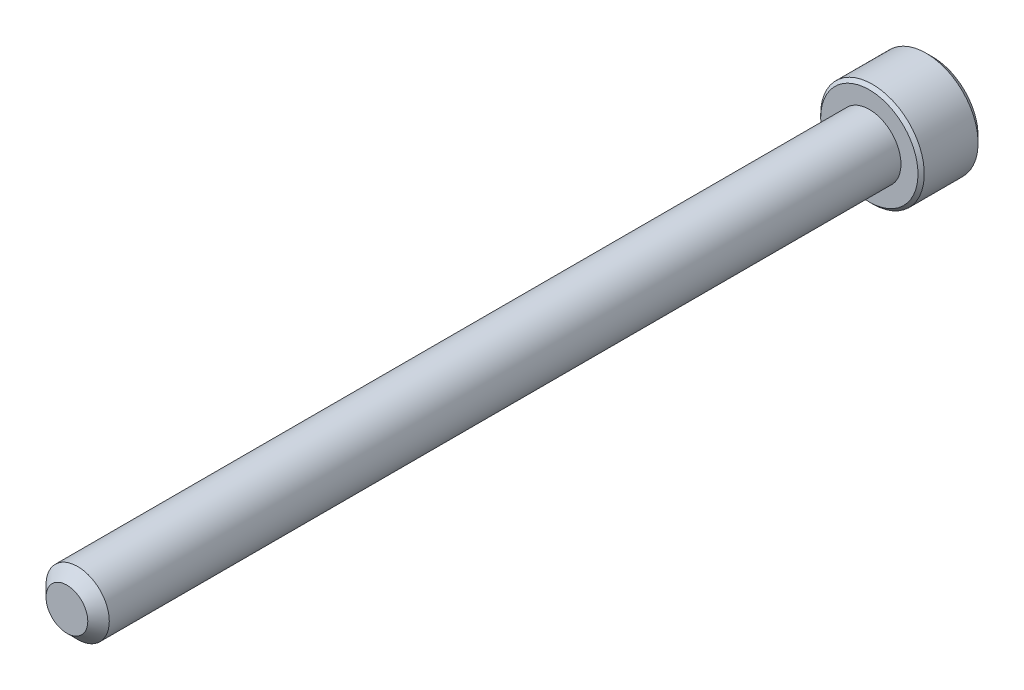
ISO-10303-21;
HEADER;
FILE_DESCRIPTION(('STEP AP214'),'2;1');
FILE_NAME('part.step','',(''),(''),'','','');
FILE_SCHEMA(('AUTOMOTIVE_DESIGN { 1 0 10303 214 1 1 1 1 }'));
ENDSEC;
DATA;
#1=APPLICATION_CONTEXT('core data for automotive mechanical design processes');
#2=APPLICATION_PROTOCOL_DEFINITION('international standard','automotive_design',2000,#1);
#3=PRODUCT_CONTEXT('',#1,'mechanical');
#4=PRODUCT('Part','Part','',(#3));
#5=PRODUCT_RELATED_PRODUCT_CATEGORY('part','',(#4));
#6=PRODUCT_DEFINITION_FORMATION('','',#4);
#7=PRODUCT_DEFINITION_CONTEXT('part definition',#1,'design');
#8=PRODUCT_DEFINITION('design','',#6,#7);
#9=PRODUCT_DEFINITION_SHAPE('','',#8);
#10=(LENGTH_UNIT() NAMED_UNIT(*) SI_UNIT(.MILLI.,.METRE.));
#11=(NAMED_UNIT(*) PLANE_ANGLE_UNIT() SI_UNIT($,.RADIAN.));
#12=(NAMED_UNIT(*) SI_UNIT($,.STERADIAN.) SOLID_ANGLE_UNIT());
#13=UNCERTAINTY_MEASURE_WITH_UNIT(LENGTH_MEASURE(1.E-05),#10,'distance_accuracy_value','');
#14=(GEOMETRIC_REPRESENTATION_CONTEXT(3) GLOBAL_UNCERTAINTY_ASSIGNED_CONTEXT((#13)) GLOBAL_UNIT_ASSIGNED_CONTEXT((#10,
#11,#12)) REPRESENTATION_CONTEXT('',''));
#15=CARTESIAN_POINT('',(0.,0.,0.));
#16=DIRECTION('',(0.,0.,1.));
#17=DIRECTION('',(1.,0.,0.));
#18=AXIS2_PLACEMENT_3D('',#15,#16,#17);
#19=CARTESIAN_POINT('',(0.,0.,-44.45));
#20=DIRECTION('',(0.,0.,1.));
#21=DIRECTION('',(1.,0.,0.));
#22=AXIS2_PLACEMENT_3D('',#19,#20,#21);
#23=CYLINDRICAL_SURFACE('',#22,1.7526);
#24=CARTESIAN_POINT('',(0.,0.,-44.45));
#25=DIRECTION('',(0.,0.,-1.));
#26=DIRECTION('',(-1.,0.,0.));
#27=AXIS2_PLACEMENT_3D('',#24,#25,#26);
#28=CIRCLE('',#27,1.7526);
#29=CARTESIAN_POINT('',(-1.7526,0.,-44.45));
#30=VERTEX_POINT('',#29);
#31=EDGE_CURVE('E215',#30,#30,#28,.F.);
#32=ORIENTED_EDGE('',*,*,#31,.T.);
#33=EDGE_LOOP('',(#32));
#34=FACE_BOUND('',#33,.T.);
#35=CARTESIAN_POINT('',(0.,0.,-0.5953125));
#36=DIRECTION('',(0.,0.,1.));
#37=DIRECTION('',(1.,0.,0.));
#38=AXIS2_PLACEMENT_3D('',#35,#36,#37);
#39=CIRCLE('',#38,1.7526);
#40=CARTESIAN_POINT('',(1.7526,0.,-0.5953125));
#41=VERTEX_POINT('',#40);
#42=EDGE_CURVE('E111',#41,#41,#39,.F.);
#43=ORIENTED_EDGE('',*,*,#42,.T.);
#44=EDGE_LOOP('',(#43));
#45=FACE_BOUND('',#44,.T.);
#46=ADVANCED_FACE('F37',(#34,#45),#23,.T.);
#47=CARTESIAN_POINT('',(0.,0.,0.));
#48=DIRECTION('',(0.,0.,1.));
#49=DIRECTION('',(1.,0.,0.));
#50=AXIS2_PLACEMENT_3D('',#47,#48,#49);
#51=PLANE('',#50);
#52=CARTESIAN_POINT('',(0.,0.,0.));
#53=DIRECTION('',(0.,0.,1.));
#54=DIRECTION('',(1.,0.,0.));
#55=AXIS2_PLACEMENT_3D('',#52,#53,#54);
#56=CIRCLE('',#55,1.15728750000001);
#57=CARTESIAN_POINT('',(1.15728750000001,0.,0.));
#58=VERTEX_POINT('',#57);
#59=EDGE_CURVE('E214',#58,#58,#56,.T.);
#60=ORIENTED_EDGE('',*,*,#59,.T.);
#61=EDGE_LOOP('',(#60));
#62=FACE_BOUND('',#61,.T.);
#63=ADVANCED_FACE('F191',(#62),#51,.T.);
#64=CARTESIAN_POINT('',(0.,0.,0.));
#65=DIRECTION('',(0.,0.,-1.));
#66=DIRECTION('',(-1.,0.,0.));
#67=AXIS2_PLACEMENT_3D('',#64,#65,#66);
#68=CONICAL_SURFACE('',#67,1.15728750000001,0.785398163397443);
#69=ORIENTED_EDGE('',*,*,#42,.F.);
#70=EDGE_LOOP('',(#69));
#71=FACE_BOUND('',#70,.T.);
#72=ORIENTED_EDGE('',*,*,#59,.F.);
#73=EDGE_LOOP('',(#72));
#74=FACE_BOUND('',#73,.T.);
#75=ADVANCED_FACE('F197',(#71,#74),#68,.T.);
#76=CARTESIAN_POINT('',(0.,0.,-47.9552));
#77=DIRECTION('',(0.,0.,1.));
#78=DIRECTION('',(1.,0.,0.));
#79=AXIS2_PLACEMENT_3D('',#76,#77,#78);
#80=CYLINDRICAL_SURFACE('',#79,2.8702);
#81=CARTESIAN_POINT('',(0.,0.,-44.62526));
#82=DIRECTION('',(0.,0.,-1.));
#83=DIRECTION('',(-1.,0.,0.));
#84=AXIS2_PLACEMENT_3D('',#81,#82,#83);
#85=CIRCLE('',#84,2.8702);
#86=CARTESIAN_POINT('',(-2.8702,0.,-44.62526));
#87=VERTEX_POINT('',#86);
#88=EDGE_CURVE('E45',#87,#87,#85,.T.);
#89=ORIENTED_EDGE('',*,*,#88,.T.);
#90=EDGE_LOOP('',(#89));
#91=FACE_BOUND('',#90,.T.);
#92=CARTESIAN_POINT('',(0.,0.,-47.60468));
#93=DIRECTION('',(0.,0.,-1.));
#94=DIRECTION('',(-1.,0.,0.));
#95=AXIS2_PLACEMENT_3D('',#92,#93,#94);
#96=CIRCLE('',#95,2.8702);
#97=CARTESIAN_POINT('',(-2.8702,0.,-47.60468));
#98=VERTEX_POINT('',#97);
#99=EDGE_CURVE('E174',#98,#98,#96,.F.);
#100=ORIENTED_EDGE('',*,*,#99,.T.);
#101=EDGE_LOOP('',(#100));
#102=FACE_BOUND('',#101,.T.);
#103=ADVANCED_FACE('F179',(#91,#102),#80,.T.);
#104=CARTESIAN_POINT('',(0.,0.,-47.9552));
#105=DIRECTION('',(0.,0.,-1.));
#106=DIRECTION('',(-1.,0.,0.));
#107=AXIS2_PLACEMENT_3D('',#104,#105,#106);
#108=PLANE('',#107);
#109=CARTESIAN_POINT('',(0.,0.,-47.9552));
#110=DIRECTION('',(0.,0.,-1.));
#111=DIRECTION('',(-1.,0.,0.));
#112=AXIS2_PLACEMENT_3D('',#109,#110,#111);
#113=CIRCLE('',#112,2.51968);
#114=CARTESIAN_POINT('',(-2.51968,0.,-47.9552));
#115=VERTEX_POINT('',#114);
#116=EDGE_CURVE('E110',#115,#115,#113,.T.);
#117=ORIENTED_EDGE('',*,*,#116,.T.);
#118=EDGE_LOOP('',(#117));
#119=FACE_BOUND('',#118,.T.);
#120=CARTESIAN_POINT('',(0.,0.,-47.9552));
#121=DIRECTION('',(0.,0.,-1.));
#122=DIRECTION('',(-1.,0.,0.));
#123=AXIS2_PLACEMENT_3D('',#120,#121,#122);
#124=CIRCLE('',#123,1.60395121659243);
#125=CARTESIAN_POINT('',(-1.3890625,0.801975608296215,-47.9552));
#126=VERTEX_POINT('',#125);
#127=CARTESIAN_POINT('',(0.,1.60395121659243,-47.9552));
#128=VERTEX_POINT('',#127);
#129=EDGE_CURVE('E91',#126,#128,#124,.T.);
#130=ORIENTED_EDGE('',*,*,#129,.F.);
#131=CARTESIAN_POINT('',(-1.3890625,-0.801975608296215,-47.9552));
#132=VERTEX_POINT('',#131);
#133=EDGE_CURVE('E51',#132,#126,#124,.T.);
#134=ORIENTED_EDGE('',*,*,#133,.F.);
#135=CARTESIAN_POINT('',(0.,-1.60395121659243,-47.9552));
#136=VERTEX_POINT('',#135);
#137=EDGE_CURVE('E273',#136,#132,#124,.T.);
#138=ORIENTED_EDGE('',*,*,#137,.F.);
#139=CARTESIAN_POINT('',(1.3890625,-0.801975608296215,-47.9552));
#140=VERTEX_POINT('',#139);
#141=EDGE_CURVE('E58',#140,#136,#124,.T.);
#142=ORIENTED_EDGE('',*,*,#141,.F.);
#143=CARTESIAN_POINT('',(1.3890625,0.801975608296215,-47.9552));
#144=VERTEX_POINT('',#143);
#145=EDGE_CURVE('E132',#144,#140,#124,.T.);
#146=ORIENTED_EDGE('',*,*,#145,.F.);
#147=EDGE_CURVE('E100',#128,#144,#124,.T.);
#148=ORIENTED_EDGE('',*,*,#147,.F.);
#149=EDGE_LOOP('',(#130,#134,#138,#142,#146,#148));
#150=FACE_BOUND('',#149,.T.);
#151=ADVANCED_FACE('F131',(#119,#150),#108,.T.);
#152=CARTESIAN_POINT('',(0.,0.,-44.45));
#153=DIRECTION('',(0.,0.,-1.));
#154=DIRECTION('',(-1.,0.,0.));
#155=AXIS2_PLACEMENT_3D('',#152,#153,#154);
#156=PLANE('',#155);
#157=CARTESIAN_POINT('',(0.,0.,-44.45));
#158=DIRECTION('',(0.,0.,-1.));
#159=DIRECTION('',(-1.,0.,0.));
#160=AXIS2_PLACEMENT_3D('',#157,#158,#159);
#161=CIRCLE('',#160,2.69493999999999);
#162=CARTESIAN_POINT('',(-2.69493999999999,0.,-44.45));
#163=VERTEX_POINT('',#162);
#164=EDGE_CURVE('E11',#163,#163,#161,.F.);
#165=ORIENTED_EDGE('',*,*,#164,.T.);
#166=EDGE_LOOP('',(#165));
#167=FACE_BOUND('',#166,.T.);
#168=ORIENTED_EDGE('',*,*,#31,.F.);
#169=EDGE_LOOP('',(#168));
#170=FACE_BOUND('',#169,.T.);
#171=ADVANCED_FACE('F285',(#167,#170),#156,.F.);
#172=CARTESIAN_POINT('',(0.,0.,-47.9552));
#173=DIRECTION('',(0.,0.,-1.));
#174=DIRECTION('',(-1.,0.,0.));
#175=AXIS2_PLACEMENT_3D('',#172,#173,#174);
#176=CONICAL_SURFACE('',#175,1.60395121659243,0.78539816339745);
#177=ORIENTED_EDGE('',*,*,#147,.T.);
#178=CARTESIAN_POINT('',(-0.000200000000000315,1.60406668664627,-47.9553154825221));
#179=CARTESIAN_POINT('',(0.0475548148995858,1.57649543140889,-47.927764786881));
#180=CARTESIAN_POINT('',(0.0961082129767672,1.54846311395896,-47.9018319141145));
#181=CARTESIAN_POINT('',(0.195114281423184,1.49130193369001,-47.8543489608708));
#182=CARTESIAN_POINT('',(0.24557637273014,1.46216763169007,-47.8328253080794));
#183=CARTESIAN_POINT('',(0.347330835284909,1.40341966534283,-47.7959546019866));
#184=CARTESIAN_POINT('',(0.398597278416375,1.37382097060048,-47.7805148513149));
#185=CARTESIAN_POINT('',(0.502259069123938,1.31397180783079,-47.7567264581829));
#186=CARTESIAN_POINT('',(0.554651247789432,1.28372316937484,-47.7483600517165));
#187=CARTESIAN_POINT('',(0.644944084544835,1.23159257576821,-47.7408113663708));
#188=CARTESIAN_POINT('',(0.682728034255601,1.20977800223165,-47.7396936971037));
#189=CARTESIAN_POINT('',(0.758229287800437,1.16618733317339,-47.7415750513552));
#190=CARTESIAN_POINT('',(0.795946575086518,1.14441124720567,-47.7445749834253));
#191=CARTESIAN_POINT('',(0.871018018906521,1.10106872890773,-47.7545189567457));
#192=CARTESIAN_POINT('',(0.908371804329554,1.0795025108385,-47.7614666704902));
#193=CARTESIAN_POINT('',(0.98245243559604,1.03673203843505,-47.7789288810594));
#194=CARTESIAN_POINT('',(1.01917900521513,1.01552794357906,-47.7894449088769));
#195=CARTESIAN_POINT('',(1.11325413716703,0.961213640822577,-47.8206664203823));
#196=CARTESIAN_POINT('',(1.17001916310317,0.928440337817793,-47.8437263608604));
#197=CARTESIAN_POINT('',(1.25348479270274,0.880251434100401,-47.8826547118294));
#198=CARTESIAN_POINT('',(1.28098915116073,0.864371785340789,-47.8963318145832));
#199=CARTESIAN_POINT('',(1.33549195495674,0.832904576897576,-47.9249348081189));
#200=CARTESIAN_POINT('',(1.36249063449213,0.817316882000055,-47.9398601023926));
#201=CARTESIAN_POINT('',(1.3892625,0.801860138242376,-47.9553154825221));
#202=B_SPLINE_CURVE_WITH_KNOTS('',3,(#178,#179,#180,#181,#182,#183,#184,#185,#186,#187,#188,
#189,#190,#191,#192,#193,#194,#195,#196,#197,#198,#199,#200,#201),.UNSPECIFIED.,.F.,.F.,(4,2,2,
2,2,2,2,2,2,2,2,4),(0.,0.185054161583332,0.371186974731967,0.554362620151554,0.737076859824673,
0.867821902366108,0.998595798526819,1.12949154907136,1.26044353188444,1.46846066168042,
1.57218026599104,1.67585058309997),.UNSPECIFIED.);
#203=EDGE_CURVE('E105',#128,#144,#202,.T.);
#204=ORIENTED_EDGE('',*,*,#203,.F.);
#205=EDGE_LOOP('',(#177,#204));
#206=FACE_BOUND('',#205,.T.);
#207=ADVANCED_FACE('F106',(#206),#176,.F.);
#208=ORIENTED_EDGE('',*,*,#145,.T.);
#209=CARTESIAN_POINT('',(1.3890625,-1.61940394489368,-48.4847819482877));
#210=CARTESIAN_POINT('',(1.3890625,-1.58006115357525,-48.4549243272552));
#211=CARTESIAN_POINT('',(1.3890625,-1.54050132963141,-48.4253535181953));
#212=CARTESIAN_POINT('',(1.3890625,-1.46085876249422,-48.3669045446939));
#213=CARTESIAN_POINT('',(1.3890625,-1.42077589253949,-48.3380265531591));
#214=CARTESIAN_POINT('',(1.3890625,-1.29902275003757,-48.2521982113821));
#215=CARTESIAN_POINT('',(1.3890625,-1.21644571530268,-48.1965129842656));
#216=CARTESIAN_POINT('',(1.3890625,-1.04315507982622,-48.0870119607219));
#217=CARTESIAN_POINT('',(1.3890625,-0.952248476237839,-48.0334981976636));
#218=CARTESIAN_POINT('',(1.3890625,-0.76586952516284,-47.9354818620486));
#219=CARTESIAN_POINT('',(1.3890625,-0.670413981877766,-47.890948887149));
#220=CARTESIAN_POINT('',(1.3890625,-0.52732418584374,-47.8364610332824));
#221=CARTESIAN_POINT('',(1.3890625,-0.481850777061389,-47.8208565157831));
#222=CARTESIAN_POINT('',(1.3890625,-0.389788715503719,-47.7932958930258));
#223=CARTESIAN_POINT('',(1.3890625,-0.343199987802588,-47.7813400336264));
#224=CARTESIAN_POINT('',(1.3890625,-0.249973786444528,-47.7619026509047));
#225=CARTESIAN_POINT('',(1.3890625,-0.203352812925125,-47.7543432373505));
#226=CARTESIAN_POINT('',(1.3890625,-0.109590268853036,-47.7438495716392));
#227=CARTESIAN_POINT('',(1.3890625,-0.0624487940946397,-47.7409144822412));
#228=CARTESIAN_POINT('',(1.3890625,0.0300876528150627,-47.7398959870303));
#229=CARTESIAN_POINT('',(1.3890625,0.0754806898624751,-47.7416318778665));
#230=CARTESIAN_POINT('',(1.3890625,0.165887419987696,-47.7494562074429));
#231=CARTESIAN_POINT('',(1.3890625,0.210901076401208,-47.7555450620931));
#232=CARTESIAN_POINT('',(1.3890625,0.30098558475462,-47.7718429070995));
#233=CARTESIAN_POINT('',(1.3890625,0.346043426422373,-47.7821227134034));
#234=CARTESIAN_POINT('',(1.3890625,0.435171985737649,-47.8062501165793));
#235=CARTESIAN_POINT('',(1.3890625,0.479242778713589,-47.8200974401744));
#236=CARTESIAN_POINT('',(1.3890625,0.617097855065661,-47.8686456952639));
#237=CARTESIAN_POINT('',(1.3890625,0.708943143304685,-47.9088382622647));
#238=CARTESIAN_POINT('',(1.3890625,0.888326863224004,-47.9982263267703));
#239=CARTESIAN_POINT('',(1.3890625,0.97584844298917,-48.0474539889421));
#240=CARTESIAN_POINT('',(1.3890625,1.14312734284962,-48.1490417915907));
#241=CARTESIAN_POINT('',(1.3890625,1.22305448909244,-48.2011257683416));
#242=CARTESIAN_POINT('',(1.3890625,1.3408107214192,-48.2816537578048));
#243=CARTESIAN_POINT('',(1.3890625,1.37955507355712,-48.3087826123911));
#244=CARTESIAN_POINT('',(1.3890625,1.45651364152892,-48.3637608318921));
#245=CARTESIAN_POINT('',(1.3890625,1.49472800034328,-48.3916099964369));
#246=CARTESIAN_POINT('',(1.3890625,1.53272159235226,-48.4197579346005));
#247=B_SPLINE_CURVE_WITH_KNOTS('',3,(#209,#210,#211,#212,#213,#214,#215,#216,#217,#218,#219,
#220,#221,#222,#223,#224,#225,#226,#227,#228,#229,#230,#231,#232,#233,#234,#235,#236,#237,#238,
#239,#240,#241,#242,#243,#244,#245,#246),.UNSPECIFIED.,.F.,.F.,(4,2,2,2,2,2,2,2,2,2,2,2,2,2,2,2,
2,2,4),(0.,0.148165097745701,0.296366796341796,0.595030749902561,0.911241326980938,
1.22636278201588,1.37047020899011,1.51458734424994,1.65606664398604,1.79752032573526,
1.93358111299144,2.06965490210103,2.20813012764229,2.34659474893434,2.6464783559792,
2.9474510101762,3.23350725556849,3.37539574682858,3.5172451844487),.UNSPECIFIED.);
#248=EDGE_CURVE('E99',#144,#140,#247,.F.);
#249=ORIENTED_EDGE('',*,*,#248,.F.);
#250=EDGE_LOOP('',(#208,#249));
#251=FACE_BOUND('',#250,.T.);
#252=ADVANCED_FACE('F279',(#251),#176,.F.);
#253=ORIENTED_EDGE('',*,*,#141,.T.);
#254=CARTESIAN_POINT('',(1.3892625,-0.801860138242377,-47.9553154825221));
#255=CARTESIAN_POINT('',(1.34150768510041,-0.829431393479754,-47.927764786881));
#256=CARTESIAN_POINT('',(1.29295428702323,-0.857463710929685,-47.9018319141145));
#257=CARTESIAN_POINT('',(1.19394821857682,-0.91462489119863,-47.8543489608708));
#258=CARTESIAN_POINT('',(1.14348612726986,-0.943759193198573,-47.8328253080794));
#259=CARTESIAN_POINT('',(1.04173166471509,-1.00250715954582,-47.7959546019866));
#260=CARTESIAN_POINT('',(0.990465221583624,-1.03210585428816,-47.7805148513149));
#261=CARTESIAN_POINT('',(0.886803430876062,-1.09195501705785,-47.7567264581829));
#262=CARTESIAN_POINT('',(0.834411252210568,-1.12220365551381,-47.7483600517165));
#263=CARTESIAN_POINT('',(0.744118415455165,-1.17433424912043,-47.7408113663708));
#264=CARTESIAN_POINT('',(0.706334465744399,-1.19614882265699,-47.7396936971037));
#265=CARTESIAN_POINT('',(0.630833212199563,-1.23973949171526,-47.7415750513552));
#266=CARTESIAN_POINT('',(0.593115924913482,-1.26151557768298,-47.7445749834253));
#267=CARTESIAN_POINT('',(0.518044481093479,-1.30485809598091,-47.7545189567457));
#268=CARTESIAN_POINT('',(0.480690695670445,-1.32642431405015,-47.7614666704902));
#269=CARTESIAN_POINT('',(0.406610064403958,-1.36919478645359,-47.7789288810594));
#270=CARTESIAN_POINT('',(0.369883494784871,-1.39039888130958,-47.7894449088769));
#271=CARTESIAN_POINT('',(0.275808362832965,-1.44471318406607,-47.8206664203823));
#272=CARTESIAN_POINT('',(0.21904333689683,-1.47748648707085,-47.8437263608604));
#273=CARTESIAN_POINT('',(0.135577707297262,-1.52567539078824,-47.8826547118294));
#274=CARTESIAN_POINT('',(0.108073348839266,-1.54155503954785,-47.8963318145832));
#275=CARTESIAN_POINT('',(0.0535705450432605,-1.57302224799107,-47.9249348081189));
#276=CARTESIAN_POINT('',(0.0265718655078727,-1.58860994288859,-47.9398601023926));
#277=CARTESIAN_POINT('',(-0.000200000000000224,-1.60406668664627,-47.9553154825221));
#278=B_SPLINE_CURVE_WITH_KNOTS('',3,(#254,#255,#256,#257,#258,#259,#260,#261,#262,#263,#264,
#265,#266,#267,#268,#269,#270,#271,#272,#273,#274,#275,#276,#277),.UNSPECIFIED.,.F.,.F.,(4,2,2,
2,2,2,2,2,2,2,2,4),(0.,0.185054161583332,0.371186974731968,0.554362620151554,0.737076859824673,
0.867821902366107,0.998595798526818,1.12949154907137,1.26044353188444,1.46846066168042,
1.57218026599104,1.67585058309997),.UNSPECIFIED.);
#279=EDGE_CURVE('E142',#140,#136,#278,.T.);
#280=ORIENTED_EDGE('',*,*,#279,.F.);
#281=EDGE_LOOP('',(#253,#280));
#282=FACE_BOUND('',#281,.T.);
#283=ADVANCED_FACE('F276',(#282),#176,.F.);
#284=ORIENTED_EDGE('',*,*,#137,.T.);
#285=CARTESIAN_POINT('',(0.000200000000000818,-1.60406668664627,-47.9553154825221));
#286=CARTESIAN_POINT('',(-0.0475548148995854,-1.57649543140889,-47.927764786881));
#287=CARTESIAN_POINT('',(-0.0961082129767668,-1.54846311395896,-47.9018319141145));
#288=CARTESIAN_POINT('',(-0.195114281423183,-1.49130193369001,-47.8543489608708));
#289=CARTESIAN_POINT('',(-0.24557637273014,-1.46216763169007,-47.8328253080794));
#290=CARTESIAN_POINT('',(-0.347330835284909,-1.40341966534283,-47.7959546019866));
#291=CARTESIAN_POINT('',(-0.398597278416375,-1.37382097060048,-47.7805148513149));
#292=CARTESIAN_POINT('',(-0.502259069123938,-1.31397180783079,-47.7567264581829));
#293=CARTESIAN_POINT('',(-0.554651247789432,-1.28372316937484,-47.7483600517165));
#294=CARTESIAN_POINT('',(-0.644944084544834,-1.23159257576821,-47.7408113663708));
#295=CARTESIAN_POINT('',(-0.6827280342556,-1.20977800223165,-47.7396936971037));
#296=CARTESIAN_POINT('',(-0.758229287800437,-1.16618733317339,-47.7415750513552));
#297=CARTESIAN_POINT('',(-0.795946575086518,-1.14441124720567,-47.7445749834253));
#298=CARTESIAN_POINT('',(-0.87101801890652,-1.10106872890774,-47.7545189567457));
#299=CARTESIAN_POINT('',(-0.908371804329554,-1.0795025108385,-47.7614666704902));
#300=CARTESIAN_POINT('',(-0.982452435596041,-1.03673203843505,-47.7789288810594));
#301=CARTESIAN_POINT('',(-1.01917900521513,-1.01552794357906,-47.7894449088769));
#302=CARTESIAN_POINT('',(-1.11325413716703,-0.961213640822577,-47.8206664203823));
#303=CARTESIAN_POINT('',(-1.17001916310317,-0.928440337817793,-47.8437263608604));
#304=CARTESIAN_POINT('',(-1.25348479270274,-0.880251434100401,-47.8826547118294));
#305=CARTESIAN_POINT('',(-1.28098915116073,-0.864371785340789,-47.8963318145832));
#306=CARTESIAN_POINT('',(-1.33549195495674,-0.832904576897576,-47.9249348081189));
#307=CARTESIAN_POINT('',(-1.36249063449213,-0.817316882000055,-47.9398601023926));
#308=CARTESIAN_POINT('',(-1.3892625,-0.801860138242376,-47.9553154825221));
#309=B_SPLINE_CURVE_WITH_KNOTS('',3,(#285,#286,#287,#288,#289,#290,#291,#292,#293,#294,#295,
#296,#297,#298,#299,#300,#301,#302,#303,#304,#305,#306,#307,#308),.UNSPECIFIED.,.F.,.F.,(4,2,2,
2,2,2,2,2,2,2,2,4),(0.,0.185054161583332,0.371186974731967,0.554362620151555,0.737076859824673,
0.867821902366107,0.998595798526818,1.12949154907137,1.26044353188444,1.46846066168042,
1.57218026599104,1.67585058309997),.UNSPECIFIED.);
#310=EDGE_CURVE('E250',#136,#132,#309,.T.);
#311=ORIENTED_EDGE('',*,*,#310,.F.);
#312=EDGE_LOOP('',(#284,#311));
#313=FACE_BOUND('',#312,.T.);
#314=ADVANCED_FACE('F275',(#313),#176,.F.);
#315=ORIENTED_EDGE('',*,*,#133,.T.);
#316=CARTESIAN_POINT('',(-1.3890625,-1.61940394489368,-48.4847819482877));
#317=CARTESIAN_POINT('',(-1.3890625,-1.58006115357525,-48.4549243272552));
#318=CARTESIAN_POINT('',(-1.3890625,-1.54050132963141,-48.4253535181953));
#319=CARTESIAN_POINT('',(-1.3890625,-1.46085876249422,-48.3669045446939));
#320=CARTESIAN_POINT('',(-1.3890625,-1.42077589253949,-48.3380265531591));
#321=CARTESIAN_POINT('',(-1.3890625,-1.29902275003757,-48.2521982113821));
#322=CARTESIAN_POINT('',(-1.3890625,-1.21644571530268,-48.1965129842656));
#323=CARTESIAN_POINT('',(-1.3890625,-1.04315507982622,-48.0870119607219));
#324=CARTESIAN_POINT('',(-1.3890625,-0.952248476237838,-48.0334981976636));
#325=CARTESIAN_POINT('',(-1.3890625,-0.765869525162839,-47.9354818620486));
#326=CARTESIAN_POINT('',(-1.3890625,-0.670413981877766,-47.890948887149));
#327=CARTESIAN_POINT('',(-1.3890625,-0.527324185843739,-47.8364610332824));
#328=CARTESIAN_POINT('',(-1.3890625,-0.481850777061388,-47.8208565157831));
#329=CARTESIAN_POINT('',(-1.3890625,-0.389788715503718,-47.7932958930258));
#330=CARTESIAN_POINT('',(-1.3890625,-0.343199987802587,-47.7813400336264));
#331=CARTESIAN_POINT('',(-1.3890625,-0.249973786444527,-47.7619026509047));
#332=CARTESIAN_POINT('',(-1.3890625,-0.203352812925124,-47.7543432373505));
#333=CARTESIAN_POINT('',(-1.3890625,-0.109590268853035,-47.7438495716392));
#334=CARTESIAN_POINT('',(-1.3890625,-0.0624487940946387,-47.7409144822411));
#335=CARTESIAN_POINT('',(-1.3890625,0.0300876528150635,-47.7398959870303));
#336=CARTESIAN_POINT('',(-1.3890625,0.0754806898624756,-47.7416318778665));
#337=CARTESIAN_POINT('',(-1.3890625,0.165887419987697,-47.7494562074429));
#338=CARTESIAN_POINT('',(-1.3890625,0.210901076401208,-47.7555450620931));
#339=CARTESIAN_POINT('',(-1.3890625,0.300985584754621,-47.7718429070995));
#340=CARTESIAN_POINT('',(-1.3890625,0.346043426422374,-47.7821227134034));
#341=CARTESIAN_POINT('',(-1.3890625,0.43517198573765,-47.8062501165793));
#342=CARTESIAN_POINT('',(-1.3890625,0.47924277871359,-47.8200974401745));
#343=CARTESIAN_POINT('',(-1.3890625,0.617097855065663,-47.8686456952638));
#344=CARTESIAN_POINT('',(-1.3890625,0.708943143304685,-47.9088382622647));
#345=CARTESIAN_POINT('',(-1.3890625,0.888326863224004,-47.9982263267703));
#346=CARTESIAN_POINT('',(-1.3890625,0.975848442989171,-48.0474539889421));
#347=CARTESIAN_POINT('',(-1.3890625,1.14312734284962,-48.1490417915907));
#348=CARTESIAN_POINT('',(-1.3890625,1.22305448909244,-48.2011257683416));
#349=CARTESIAN_POINT('',(-1.3890625,1.3408107214192,-48.2816537578048));
#350=CARTESIAN_POINT('',(-1.3890625,1.37955507355712,-48.3087826123911));
#351=CARTESIAN_POINT('',(-1.3890625,1.45651364152893,-48.3637608318921));
#352=CARTESIAN_POINT('',(-1.3890625,1.49472800034328,-48.3916099964369));
#353=CARTESIAN_POINT('',(-1.3890625,1.53272159235226,-48.4197579346005));
#354=B_SPLINE_CURVE_WITH_KNOTS('',3,(#316,#317,#318,#319,#320,#321,#322,#323,#324,#325,#326,
#327,#328,#329,#330,#331,#332,#333,#334,#335,#336,#337,#338,#339,#340,#341,#342,#343,#344,#345,
#346,#347,#348,#349,#350,#351,#352,#353),.UNSPECIFIED.,.F.,.F.,(4,2,2,2,2,2,2,2,2,2,2,2,2,2,2,2,
2,2,4),(0.,0.1481650977457,0.296366796341794,0.595030749902561,0.911241326980938,
1.22636278201588,1.37047020899011,1.51458734424994,1.65606664398604,1.79752032573526,
1.93358111299144,2.06965490210103,2.20813012764229,2.34659474893433,2.6464783559792,
2.94745101017619,3.23350725556849,3.37539574682858,3.5172451844487),.UNSPECIFIED.);
#355=EDGE_CURVE('E121',#132,#126,#354,.T.);
#356=ORIENTED_EDGE('',*,*,#355,.F.);
#357=EDGE_LOOP('',(#315,#356));
#358=FACE_BOUND('',#357,.T.);
#359=ADVANCED_FACE('F292',(#358),#176,.F.);
#360=ORIENTED_EDGE('',*,*,#129,.T.);
#361=CARTESIAN_POINT('',(-1.3892625,0.801860138242376,-47.9553154825221));
#362=CARTESIAN_POINT('',(-1.34150768510041,0.829431393479753,-47.927764786881));
#363=CARTESIAN_POINT('',(-1.29295428702323,0.857463710929685,-47.9018319141145));
#364=CARTESIAN_POINT('',(-1.19394821857682,0.91462489119863,-47.8543489608708));
#365=CARTESIAN_POINT('',(-1.14348612726986,0.943759193198573,-47.8328253080794));
#366=CARTESIAN_POINT('',(-1.04173166471509,1.00250715954581,-47.7959546019866));
#367=CARTESIAN_POINT('',(-0.990465221583624,1.03210585428816,-47.7805148513149));
#368=CARTESIAN_POINT('',(-0.886803430876062,1.09195501705785,-47.7567264581829));
#369=CARTESIAN_POINT('',(-0.834411252210568,1.1222036555138,-47.7483600517165));
#370=CARTESIAN_POINT('',(-0.744118415455165,1.17433424912043,-47.7408113663708));
#371=CARTESIAN_POINT('',(-0.706334465744399,1.19614882265699,-47.7396936971037));
#372=CARTESIAN_POINT('',(-0.630833212199562,1.23973949171526,-47.7415750513552));
#373=CARTESIAN_POINT('',(-0.593115924913481,1.26151557768298,-47.7445749834253));
#374=CARTESIAN_POINT('',(-0.518044481093479,1.30485809598091,-47.7545189567457));
#375=CARTESIAN_POINT('',(-0.480690695670445,1.32642431405015,-47.7614666704902));
#376=CARTESIAN_POINT('',(-0.406610064403959,1.36919478645359,-47.7789288810594));
#377=CARTESIAN_POINT('',(-0.369883494784871,1.39039888130958,-47.7894449088769));
#378=CARTESIAN_POINT('',(-0.275808362832966,1.44471318406607,-47.8206664203823));
#379=CARTESIAN_POINT('',(-0.219043336896832,1.47748648707085,-47.8437263608604));
#380=CARTESIAN_POINT('',(-0.135577707297265,1.52567539078824,-47.8826547118294));
#381=CARTESIAN_POINT('',(-0.108073348839268,1.54155503954785,-47.8963318145832));
#382=CARTESIAN_POINT('',(-0.0535705450432611,1.57302224799107,-47.9249348081189));
#383=CARTESIAN_POINT('',(-0.0265718655078726,1.58860994288859,-47.9398601023926));
#384=CARTESIAN_POINT('',(0.00020000000000096,1.60406668664627,-47.9553154825221));
#385=B_SPLINE_CURVE_WITH_KNOTS('',3,(#361,#362,#363,#364,#365,#366,#367,#368,#369,#370,#371,
#372,#373,#374,#375,#376,#377,#378,#379,#380,#381,#382,#383,#384),.UNSPECIFIED.,.F.,.F.,(4,2,2,
2,2,2,2,2,2,2,2,4),(0.,0.185054161583332,0.371186974731968,0.554362620151554,0.737076859824673,
0.867821902366108,0.998595798526819,1.12949154907136,1.26044353188444,1.46846066168042,
1.57218026599104,1.67585058309997),.UNSPECIFIED.);
#386=EDGE_CURVE('E95',#126,#128,#385,.T.);
#387=ORIENTED_EDGE('',*,*,#386,.F.);
#388=EDGE_LOOP('',(#360,#387));
#389=FACE_BOUND('',#388,.T.);
#390=ADVANCED_FACE('F93',(#389),#176,.F.);
#391=CARTESIAN_POINT('',(1.3890625,2.40592682488864,-45.87160625));
#392=DIRECTION('',(0.,0.,-1.));
#393=DIRECTION('',(-1.,0.,0.));
#394=AXIS2_PLACEMENT_3D('',#391,#392,#393);
#395=PLANE('',#394);
#396=DIRECTION('',(0.866025403784439,0.5,0.));
#397=VECTOR('',#396,1.);
#398=CARTESIAN_POINT('',(-1.3890625,0.801975608296215,-45.87160625));
#399=LINE('',#398,#397);
#400=CARTESIAN_POINT('',(-1.3890625,0.801975608296215,-45.87160625));
#401=VERTEX_POINT('',#400);
#402=CARTESIAN_POINT('',(0.,1.60395121659243,-45.87160625));
#403=VERTEX_POINT('',#402);
#404=EDGE_CURVE('E120',#401,#403,#399,.T.);
#405=ORIENTED_EDGE('',*,*,#404,.T.);
#406=DIRECTION('',(0.866025403784439,-0.5,0.));
#407=VECTOR('',#406,1.);
#408=CARTESIAN_POINT('',(0.,1.60395121659243,-45.87160625));
#409=LINE('',#408,#407);
#410=CARTESIAN_POINT('',(1.3890625,0.801975608296215,-45.87160625));
#411=VERTEX_POINT('',#410);
#412=EDGE_CURVE('E125',#403,#411,#409,.T.);
#413=ORIENTED_EDGE('',*,*,#412,.T.);
#414=DIRECTION('',(0.,-1.,0.));
#415=VECTOR('',#414,1.);
#416=CARTESIAN_POINT('',(1.3890625,0.801975608296215,-45.87160625));
#417=LINE('',#416,#415);
#418=CARTESIAN_POINT('',(1.3890625,-0.801975608296215,-45.87160625));
#419=VERTEX_POINT('',#418);
#420=EDGE_CURVE('E236',#411,#419,#417,.T.);
#421=ORIENTED_EDGE('',*,*,#420,.T.);
#422=DIRECTION('',(-0.866025403784439,-0.5,0.));
#423=VECTOR('',#422,1.);
#424=CARTESIAN_POINT('',(1.3890625,-0.801975608296215,-45.87160625));
#425=LINE('',#424,#423);
#426=CARTESIAN_POINT('',(0.,-1.60395121659243,-45.87160625));
#427=VERTEX_POINT('',#426);
#428=EDGE_CURVE('E233',#419,#427,#425,.T.);
#429=ORIENTED_EDGE('',*,*,#428,.T.);
#430=DIRECTION('',(-0.866025403784439,0.5,0.));
#431=VECTOR('',#430,1.);
#432=CARTESIAN_POINT('',(0.,-1.60395121659243,-45.87160625));
#433=LINE('',#432,#431);
#434=CARTESIAN_POINT('',(-1.3890625,-0.801975608296215,-45.87160625));
#435=VERTEX_POINT('',#434);
#436=EDGE_CURVE('E230',#427,#435,#433,.T.);
#437=ORIENTED_EDGE('',*,*,#436,.T.);
#438=DIRECTION('',(0.,1.,0.));
#439=VECTOR('',#438,1.);
#440=CARTESIAN_POINT('',(-1.3890625,-0.801975608296215,-45.87160625));
#441=LINE('',#440,#439);
#442=EDGE_CURVE('E128',#435,#401,#441,.T.);
#443=ORIENTED_EDGE('',*,*,#442,.T.);
#444=EDGE_LOOP('',(#405,#413,#421,#429,#437,#443));
#445=FACE_BOUND('',#444,.T.);
#446=ADVANCED_FACE('F162',(#445),#395,.T.);
#447=CARTESIAN_POINT('',(0.,1.60395121659243,-45.87160625));
#448=DIRECTION('',(0.5,0.866025403784439,0.));
#449=DIRECTION('',(-0.866025403784439,0.5,0.));
#450=AXIS2_PLACEMENT_3D('',#447,#448,#449);
#451=PLANE('',#450);
#452=DIRECTION('',(0.,0.,-1.));
#453=VECTOR('',#452,1.);
#454=CARTESIAN_POINT('',(0.,1.60395121659243,-45.87160625));
#455=LINE('',#454,#453);
#456=EDGE_CURVE('E117',#403,#128,#455,.T.);
#457=ORIENTED_EDGE('',*,*,#456,.T.);
#458=ORIENTED_EDGE('',*,*,#203,.T.);
#459=DIRECTION('',(0.,0.,-1.));
#460=VECTOR('',#459,1.);
#461=CARTESIAN_POINT('',(1.3890625,0.801975608296215,-45.87160625));
#462=LINE('',#461,#460);
#463=EDGE_CURVE('E127',#411,#144,#462,.T.);
#464=ORIENTED_EDGE('',*,*,#463,.F.);
#465=ORIENTED_EDGE('',*,*,#412,.F.);
#466=EDGE_LOOP('',(#457,#458,#464,#465));
#467=FACE_BOUND('',#466,.T.);
#468=ADVANCED_FACE('F123',(#467),#451,.F.);
#469=CARTESIAN_POINT('',(1.3890625,0.801975608296215,-45.87160625));
#470=DIRECTION('',(1.,0.,0.));
#471=DIRECTION('',(0.,1.,0.));
#472=AXIS2_PLACEMENT_3D('',#469,#470,#471);
#473=PLANE('',#472);
#474=ORIENTED_EDGE('',*,*,#463,.T.);
#475=ORIENTED_EDGE('',*,*,#248,.T.);
#476=DIRECTION('',(0.,0.,-1.));
#477=VECTOR('',#476,1.);
#478=CARTESIAN_POINT('',(1.3890625,-0.801975608296215,-45.87160625));
#479=LINE('',#478,#477);
#480=EDGE_CURVE('E219',#419,#140,#479,.T.);
#481=ORIENTED_EDGE('',*,*,#480,.F.);
#482=ORIENTED_EDGE('',*,*,#420,.F.);
#483=EDGE_LOOP('',(#474,#475,#481,#482));
#484=FACE_BOUND('',#483,.T.);
#485=ADVANCED_FACE('F151',(#484),#473,.F.);
#486=CARTESIAN_POINT('',(1.3890625,-0.801975608296215,-45.87160625));
#487=DIRECTION('',(0.5,-0.866025403784439,0.));
#488=DIRECTION('',(0.866025403784439,0.5,0.));
#489=AXIS2_PLACEMENT_3D('',#486,#487,#488);
#490=PLANE('',#489);
#491=ORIENTED_EDGE('',*,*,#480,.T.);
#492=ORIENTED_EDGE('',*,*,#279,.T.);
#493=DIRECTION('',(0.,0.,-1.));
#494=VECTOR('',#493,1.);
#495=CARTESIAN_POINT('',(0.,-1.60395121659243,-45.87160625));
#496=LINE('',#495,#494);
#497=EDGE_CURVE('E222',#427,#136,#496,.T.);
#498=ORIENTED_EDGE('',*,*,#497,.F.);
#499=ORIENTED_EDGE('',*,*,#428,.F.);
#500=EDGE_LOOP('',(#491,#492,#498,#499));
#501=FACE_BOUND('',#500,.T.);
#502=ADVANCED_FACE('F155',(#501),#490,.F.);
#503=CARTESIAN_POINT('',(0.,-1.60395121659243,-45.87160625));
#504=DIRECTION('',(-0.5,-0.866025403784439,0.));
#505=DIRECTION('',(0.866025403784439,-0.5,0.));
#506=AXIS2_PLACEMENT_3D('',#503,#504,#505);
#507=PLANE('',#506);
#508=ORIENTED_EDGE('',*,*,#497,.T.);
#509=ORIENTED_EDGE('',*,*,#310,.T.);
#510=DIRECTION('',(0.,0.,-1.));
#511=VECTOR('',#510,1.);
#512=CARTESIAN_POINT('',(-1.3890625,-0.801975608296215,-45.87160625));
#513=LINE('',#512,#511);
#514=EDGE_CURVE('E225',#435,#132,#513,.T.);
#515=ORIENTED_EDGE('',*,*,#514,.F.);
#516=ORIENTED_EDGE('',*,*,#436,.F.);
#517=EDGE_LOOP('',(#508,#509,#515,#516));
#518=FACE_BOUND('',#517,.T.);
#519=ADVANCED_FACE('F258',(#518),#507,.F.);
#520=CARTESIAN_POINT('',(-1.3890625,-0.801975608296215,-45.87160625));
#521=DIRECTION('',(-1.,0.,0.));
#522=DIRECTION('',(0.,-1.,0.));
#523=AXIS2_PLACEMENT_3D('',#520,#521,#522);
#524=PLANE('',#523);
#525=ORIENTED_EDGE('',*,*,#514,.T.);
#526=ORIENTED_EDGE('',*,*,#355,.T.);
#527=DIRECTION('',(0.,0.,-1.));
#528=VECTOR('',#527,1.);
#529=CARTESIAN_POINT('',(-1.3890625,0.801975608296215,-45.87160625));
#530=LINE('',#529,#528);
#531=EDGE_CURVE('E119',#401,#126,#530,.T.);
#532=ORIENTED_EDGE('',*,*,#531,.F.);
#533=ORIENTED_EDGE('',*,*,#442,.F.);
#534=EDGE_LOOP('',(#525,#526,#532,#533));
#535=FACE_BOUND('',#534,.T.);
#536=ADVANCED_FACE('F255',(#535),#524,.F.);
#537=CARTESIAN_POINT('',(-1.3890625,0.801975608296215,-45.87160625));
#538=DIRECTION('',(-0.5,0.866025403784439,0.));
#539=DIRECTION('',(-0.866025403784439,-0.5,0.));
#540=AXIS2_PLACEMENT_3D('',#537,#538,#539);
#541=PLANE('',#540);
#542=ORIENTED_EDGE('',*,*,#531,.T.);
#543=ORIENTED_EDGE('',*,*,#386,.T.);
#544=ORIENTED_EDGE('',*,*,#456,.F.);
#545=ORIENTED_EDGE('',*,*,#404,.F.);
#546=EDGE_LOOP('',(#542,#543,#544,#545));
#547=FACE_BOUND('',#546,.T.);
#548=ADVANCED_FACE('F115',(#547),#541,.F.);
#549=CARTESIAN_POINT('',(0.,0.,-47.9552));
#550=DIRECTION('',(0.,0.,1.));
#551=DIRECTION('',(1.,0.,0.));
#552=AXIS2_PLACEMENT_3D('',#549,#550,#551);
#553=CONICAL_SURFACE('',#552,2.51968,0.785398163397454);
#554=ORIENTED_EDGE('',*,*,#99,.F.);
#555=EDGE_LOOP('',(#554));
#556=FACE_BOUND('',#555,.T.);
#557=ORIENTED_EDGE('',*,*,#116,.F.);
#558=EDGE_LOOP('',(#557));
#559=FACE_BOUND('',#558,.T.);
#560=ADVANCED_FACE('F183',(#556,#559),#553,.T.);
#561=CARTESIAN_POINT('',(0.,0.,-44.62526));
#562=DIRECTION('',(0.,0.,-1.));
#563=DIRECTION('',(-1.,0.,0.));
#564=AXIS2_PLACEMENT_3D('',#561,#562,#563);
#565=CONICAL_SURFACE('',#564,2.8702,0.785398163397457);
#566=ORIENTED_EDGE('',*,*,#164,.F.);
#567=EDGE_LOOP('',(#566));
#568=FACE_BOUND('',#567,.T.);
#569=ORIENTED_EDGE('',*,*,#88,.F.);
#570=EDGE_LOOP('',(#569));
#571=FACE_BOUND('',#570,.T.);
#572=ADVANCED_FACE('F39',(#568,#571),#565,.T.);
#573=CLOSED_SHELL('',(#46,#63,#75,#103,#151,#171,#207,#252,#283,#314,#359,#390,#446,#468,#485,
#502,#519,#536,#548,#560,#572));
#574=MANIFOLD_SOLID_BREP('B2',#573);
#575=ADVANCED_BREP_SHAPE_REPRESENTATION('',(#18,#574),#14);
#576=SHAPE_DEFINITION_REPRESENTATION(#9,#575);
ENDSEC;
END-ISO-10303-21;
